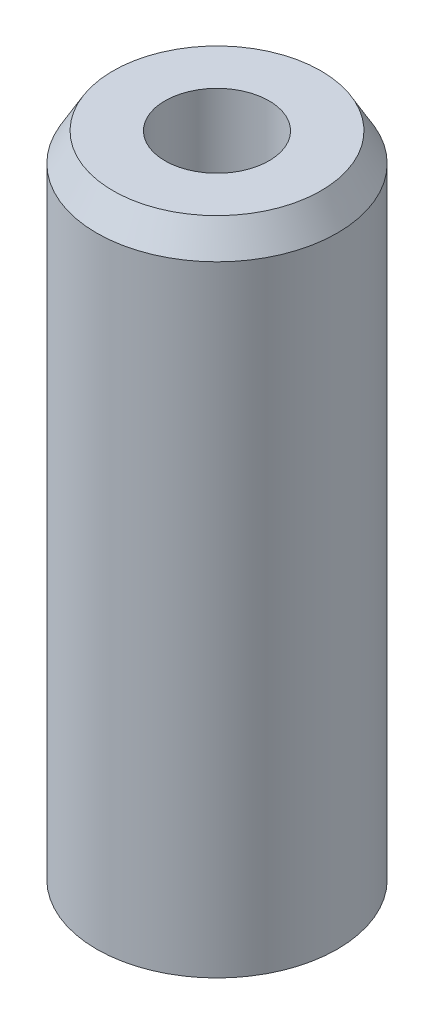
ISO-10303-21;
HEADER;
FILE_DESCRIPTION(('STEP AP214'),'2;1');
FILE_NAME('part.step','',(''),(''),'','','');
FILE_SCHEMA(('AUTOMOTIVE_DESIGN { 1 0 10303 214 1 1 1 1 }'));
ENDSEC;
DATA;
#1=APPLICATION_CONTEXT('core data for automotive mechanical design processes');
#2=APPLICATION_PROTOCOL_DEFINITION('international standard','automotive_design',2000,#1);
#3=PRODUCT_CONTEXT('',#1,'mechanical');
#4=PRODUCT('Part','Part','',(#3));
#5=PRODUCT_RELATED_PRODUCT_CATEGORY('part','',(#4));
#6=PRODUCT_DEFINITION_FORMATION('','',#4);
#7=PRODUCT_DEFINITION_CONTEXT('part definition',#1,'design');
#8=PRODUCT_DEFINITION('design','',#6,#7);
#9=PRODUCT_DEFINITION_SHAPE('','',#8);
#10=(LENGTH_UNIT() NAMED_UNIT(*) SI_UNIT(.MILLI.,.METRE.));
#11=(NAMED_UNIT(*) PLANE_ANGLE_UNIT() SI_UNIT($,.RADIAN.));
#12=(NAMED_UNIT(*) SI_UNIT($,.STERADIAN.) SOLID_ANGLE_UNIT());
#13=UNCERTAINTY_MEASURE_WITH_UNIT(LENGTH_MEASURE(1.E-05),#10,'distance_accuracy_value','');
#14=(GEOMETRIC_REPRESENTATION_CONTEXT(3) GLOBAL_UNCERTAINTY_ASSIGNED_CONTEXT((#13)) GLOBAL_UNIT_ASSIGNED_CONTEXT((#10,
#11,#12)) REPRESENTATION_CONTEXT('',''));
#15=CARTESIAN_POINT('',(0.,0.,0.));
#16=DIRECTION('',(0.,0.,1.));
#17=DIRECTION('',(1.,0.,0.));
#18=AXIS2_PLACEMENT_3D('',#15,#16,#17);
#19=CARTESIAN_POINT('',(0.,55.2616169271245,0.));
#20=DIRECTION('',(0.,-1.,0.));
#21=DIRECTION('',(0.,0.,-1.));
#22=AXIS2_PLACEMENT_3D('',#19,#20,#21);
#23=CYLINDRICAL_SURFACE('',#22,10.);
#24=CARTESIAN_POINT('',(0.,52.9019095037552,0.));
#25=DIRECTION('',(0.,1.,0.));
#26=DIRECTION('',(0.,0.,1.));
#27=AXIS2_PLACEMENT_3D('',#24,#25,#26);
#28=CIRCLE('',#27,10.);
#29=CARTESIAN_POINT('',(0.,52.9019095037552,-10.));
#30=VERTEX_POINT('',#29);
#31=EDGE_CURVE('E50',#30,#30,#28,.F.);
#32=ORIENTED_EDGE('',*,*,#31,.T.);
#33=EDGE_LOOP('',(#32));
#34=FACE_BOUND('',#33,.T.);
#35=CARTESIAN_POINT('',(0.,1.36237771609096,0.));
#36=DIRECTION('',(0.,1.,0.));
#37=DIRECTION('',(0.,0.,1.));
#38=AXIS2_PLACEMENT_3D('',#35,#36,#37);
#39=CIRCLE('',#38,10.);
#40=CARTESIAN_POINT('',(0.,1.36237771609096,10.));
#41=VERTEX_POINT('',#40);
#42=EDGE_CURVE('E51',#41,#41,#39,.T.);
#43=ORIENTED_EDGE('',*,*,#42,.T.);
#44=EDGE_LOOP('',(#43));
#45=FACE_BOUND('',#44,.T.);
#46=ADVANCED_FACE('F39',(#34,#45),#23,.T.);
#47=CARTESIAN_POINT('',(0.,55.2616169271245,0.));
#48=DIRECTION('',(0.,1.,0.));
#49=DIRECTION('',(0.,0.,1.));
#50=AXIS2_PLACEMENT_3D('',#47,#48,#49);
#51=PLANE('',#50);
#52=CARTESIAN_POINT('',(0.,55.2616169271245,0.));
#53=DIRECTION('',(0.,1.,0.));
#54=DIRECTION('',(0.,0.,1.));
#55=AXIS2_PLACEMENT_3D('',#52,#53,#54);
#56=CIRCLE('',#55,8.63762228390903);
#57=CARTESIAN_POINT('',(0.,55.2616169271245,-8.63762228390903));
#58=VERTEX_POINT('',#57);
#59=EDGE_CURVE('E54',#58,#58,#56,.T.);
#60=ORIENTED_EDGE('',*,*,#59,.T.);
#61=EDGE_LOOP('',(#60));
#62=FACE_BOUND('',#61,.T.);
#63=CARTESIAN_POINT('',(0.,55.2616169271245,0.));
#64=DIRECTION('',(0.,1.,0.));
#65=DIRECTION('',(0.,0.,1.));
#66=AXIS2_PLACEMENT_3D('',#63,#64,#65);
#67=CIRCLE('',#66,4.32399958381376);
#68=CARTESIAN_POINT('',(0.,55.2616169271245,4.32399958381376));
#69=VERTEX_POINT('',#68);
#70=EDGE_CURVE('E58',#69,#69,#67,.T.);
#71=ORIENTED_EDGE('',*,*,#70,.F.);
#72=EDGE_LOOP('',(#71));
#73=FACE_BOUND('',#72,.T.);
#74=ADVANCED_FACE('F69',(#62,#73),#51,.T.);
#75=CARTESIAN_POINT('',(0.,0.,0.));
#76=DIRECTION('',(0.,1.,0.));
#77=DIRECTION('',(0.,0.,1.));
#78=AXIS2_PLACEMENT_3D('',#75,#76,#77);
#79=PLANE('',#78);
#80=CARTESIAN_POINT('',(0.,0.,0.));
#81=DIRECTION('',(0.,1.,0.));
#82=DIRECTION('',(0.,0.,1.));
#83=AXIS2_PLACEMENT_3D('',#80,#81,#82);
#84=CIRCLE('',#83,7.64029257663081);
#85=CARTESIAN_POINT('',(0.,0.,7.64029257663081));
#86=VERTEX_POINT('',#85);
#87=EDGE_CURVE('E10',#86,#86,#84,.F.);
#88=ORIENTED_EDGE('',*,*,#87,.T.);
#89=EDGE_LOOP('',(#88));
#90=FACE_BOUND('',#89,.T.);
#91=CARTESIAN_POINT('',(0.,0.,0.));
#92=DIRECTION('',(0.,1.,0.));
#93=DIRECTION('',(0.,0.,1.));
#94=AXIS2_PLACEMENT_3D('',#91,#92,#93);
#95=CIRCLE('',#94,4.32399958381376);
#96=CARTESIAN_POINT('',(0.,0.,4.32399958381376));
#97=VERTEX_POINT('',#96);
#98=EDGE_CURVE('E63',#97,#97,#95,.T.);
#99=ORIENTED_EDGE('',*,*,#98,.T.);
#100=EDGE_LOOP('',(#99));
#101=FACE_BOUND('',#100,.T.);
#102=ADVANCED_FACE('F75',(#90,#101),#79,.F.);
#103=CARTESIAN_POINT('',(0.,55.2616169271245,0.));
#104=DIRECTION('',(0.,-1.,0.));
#105=DIRECTION('',(0.,0.,-1.));
#106=AXIS2_PLACEMENT_3D('',#103,#104,#105);
#107=CYLINDRICAL_SURFACE('',#106,4.32399958381376);
#108=ORIENTED_EDGE('',*,*,#70,.T.);
#109=EDGE_LOOP('',(#108));
#110=FACE_BOUND('',#109,.T.);
#111=ORIENTED_EDGE('',*,*,#98,.F.);
#112=EDGE_LOOP('',(#111));
#113=FACE_BOUND('',#112,.T.);
#114=ADVANCED_FACE('F70',(#110,#113),#107,.F.);
#115=CARTESIAN_POINT('',(0.,55.2616169271245,0.));
#116=DIRECTION('',(0.,-1.,0.));
#117=DIRECTION('',(0.,0.,-1.));
#118=AXIS2_PLACEMENT_3D('',#115,#116,#117);
#119=CONICAL_SURFACE('',#118,8.63762228390903,0.523598775598293);
#120=CARTESIAN_POINT('',(0.,52.9019095037552,-10.));
#121=CARTESIAN_POINT('',(0.,52.9264897894153,-9.98580856545739));
#122=CARTESIAN_POINT('',(0.,52.9510700750754,-9.97161713091477));
#123=CARTESIAN_POINT('',(0.,53.0002306463956,-9.94323426182955));
#124=CARTESIAN_POINT('',(0.,53.0248109320557,-9.92904282728693));
#125=CARTESIAN_POINT('',(0.,53.0739715033759,-9.9006599582017));
#126=CARTESIAN_POINT('',(0.,53.098551789036,-9.88646852365909));
#127=CARTESIAN_POINT('',(0.,53.1477123603562,-9.85808565457386));
#128=CARTESIAN_POINT('',(0.,53.1722926460163,-9.84389422003124));
#129=CARTESIAN_POINT('',(0.,53.2214532173365,-9.81551135094602));
#130=CARTESIAN_POINT('',(0.,53.2460335029966,-9.8013199164034));
#131=CARTESIAN_POINT('',(0.,53.2951940743168,-9.77293704731817));
#132=CARTESIAN_POINT('',(0.,53.3197743599769,-9.75874561277556));
#133=CARTESIAN_POINT('',(0.,53.3689349312971,-9.73036274369033));
#134=CARTESIAN_POINT('',(0.,53.3935152169572,-9.71617130914771));
#135=CARTESIAN_POINT('',(0.,53.4426757882774,-9.68778844006249));
#136=CARTESIAN_POINT('',(0.,53.4672560739375,-9.67359700551987));
#137=CARTESIAN_POINT('',(0.,53.5164166452577,-9.64521413643464));
#138=CARTESIAN_POINT('',(0.,53.5409969309177,-9.63102270189203));
#139=CARTESIAN_POINT('',(0.,53.5901575022379,-9.6026398328068));
#140=CARTESIAN_POINT('',(0.,53.614737787898,-9.58844839826419));
#141=CARTESIAN_POINT('',(0.,53.6638983592182,-9.56006552917896));
#142=CARTESIAN_POINT('',(0.,53.6884786448783,-9.54587409463634));
#143=CARTESIAN_POINT('',(0.,53.7376392161985,-9.51749122555112));
#144=CARTESIAN_POINT('',(0.,53.7622195018586,-9.5032997910085));
#145=CARTESIAN_POINT('',(0.,53.8113800731788,-9.47491692192327));
#146=CARTESIAN_POINT('',(0.,53.8359603588389,-9.46072548738066));
#147=CARTESIAN_POINT('',(0.,53.8851209301591,-9.43234261829543));
#148=CARTESIAN_POINT('',(0.,53.9097012158192,-9.41815118375281));
#149=CARTESIAN_POINT('',(0.,53.9588617871394,-9.38976831466759));
#150=CARTESIAN_POINT('',(0.,53.9834420727995,-9.37557688012497));
#151=CARTESIAN_POINT('',(0.,54.0326026441197,-9.34719401103974));
#152=CARTESIAN_POINT('',(0.,54.0571829297798,-9.33300257649713));
#153=CARTESIAN_POINT('',(0.,54.1063435011,-9.3046197074119));
#154=CARTESIAN_POINT('',(0.,54.1309237867601,-9.29042827286929));
#155=CARTESIAN_POINT('',(0.,54.1800843580803,-9.26204540378406));
#156=CARTESIAN_POINT('',(0.,54.2046646437404,-9.24785396924144));
#157=CARTESIAN_POINT('',(0.,54.2538252150605,-9.21947110015621));
#158=CARTESIAN_POINT('',(0.,54.2784055007206,-9.2052796656136));
#159=CARTESIAN_POINT('',(0.,54.3275660720408,-9.17689679652837));
#160=CARTESIAN_POINT('',(0.,54.3521463577009,-9.16270536198576));
#161=CARTESIAN_POINT('',(0.,54.4013069290211,-9.13432249290053));
#162=CARTESIAN_POINT('',(0.,54.4258872146812,-9.12013105835791));
#163=CARTESIAN_POINT('',(0.,54.4750477860014,-9.09174818927269));
#164=CARTESIAN_POINT('',(0.,54.4996280716615,-9.07755675473007));
#165=CARTESIAN_POINT('',(0.,54.5487886429817,-9.04917388564484));
#166=CARTESIAN_POINT('',(0.,54.5733689286418,-9.03498245110223));
#167=CARTESIAN_POINT('',(0.,54.622529499962,-9.006599582017));
#168=CARTESIAN_POINT('',(0.,54.6471097856221,-8.99240814747439));
#169=CARTESIAN_POINT('',(0.,54.6962703569423,-8.96402527838916));
#170=CARTESIAN_POINT('',(0.,54.7208506426024,-8.94983384384654));
#171=CARTESIAN_POINT('',(0.,54.7700112139226,-8.92145097476131));
#172=CARTESIAN_POINT('',(0.,54.7945914995827,-8.9072595402187));
#173=CARTESIAN_POINT('',(0.,54.8437520709029,-8.87887667113347));
#174=CARTESIAN_POINT('',(0.,54.868332356563,-8.86468523659086));
#175=CARTESIAN_POINT('',(0.,54.9174929278831,-8.83630236750563));
#176=CARTESIAN_POINT('',(0.,54.9420732135432,-8.82211093296301));
#177=CARTESIAN_POINT('',(0.,54.9912337848634,-8.79372806387779));
#178=CARTESIAN_POINT('',(0.,55.0158140705235,-8.77953662933517));
#179=CARTESIAN_POINT('',(0.,55.0649746418437,-8.75115376024994));
#180=CARTESIAN_POINT('',(0.,55.0895549275038,-8.73696232570733));
#181=CARTESIAN_POINT('',(0.,55.138715498824,-8.7085794566221));
#182=CARTESIAN_POINT('',(0.,55.1632957844841,-8.69438802207948));
#183=CARTESIAN_POINT('',(0.,55.2124563558043,-8.66600515299426));
#184=CARTESIAN_POINT('',(0.,55.2370366414644,-8.65181371845164));
#185=CARTESIAN_POINT('',(0.,55.2616169271245,-8.63762228390903));
#186=B_SPLINE_CURVE_WITH_KNOTS('',3,(#120,#121,#122,#123,#124,#125,#126,#127,#128,#129,#130,
#131,#132,#133,#134,#135,#136,#137,#138,#139,#140,#141,#142,#143,#144,#145,#146,#147,#148,#149,
#150,#151,#152,#153,#154,#155,#156,#157,#158,#159,#160,#161,#162,#163,#164,#165,#166,#167,#168,
#169,#170,#171,#172,#173,#174,#175,#176,#177,#178,#179,#180,#181,#182,#183,#184,#185),
.UNSPECIFIED.,.F.,.F.,(4,2,2,2,2,2,2,2,2,2,2,2,2,2,2,2,2,2,2,2,2,2,2,2,2,2,2,2,2,2,2,2,4),(0.,
0.0851486072556853,0.170297214511372,0.255445821767058,0.340594429022744,0.425743036278429,
0.510891643534116,0.596040250789802,0.681188858045494,0.766337465301179,0.851486072556865,
0.936634679812552,1.02178328706824,1.10693189432392,1.19208050157961,1.2772291088353,
1.36237771609099,1.44752632334667,1.53267493060236,1.61782353785805,1.70297214511373,
1.78812075236942,1.8732693596251,1.95841796688079,2.04356657413648,2.12871518139217,
2.21386378864785,2.29901239590354,2.38416100315922,2.46930961041491,2.5544582176706,
2.63960682492628,2.72475543218197),.UNSPECIFIED.);
#187=EDGE_CURVE('BSEAM81',#30,#58,#186,.T.);
#188=ORIENTED_EDGE('',*,*,#31,.F.);
#189=ORIENTED_EDGE('',*,*,#59,.F.);
#190=ORIENTED_EDGE('',*,*,#187,.T.);
#191=ORIENTED_EDGE('',*,*,#187,.F.);
#192=EDGE_LOOP('',(#188,#190,#189,#191));
#193=FACE_BOUND('',#192,.T.);
#194=ADVANCED_FACE('F81',(#193),#119,.T.);
#195=CARTESIAN_POINT('',(0.,1.36237771609096,0.));
#196=DIRECTION('',(0.,1.,0.));
#197=DIRECTION('',(0.,0.,1.));
#198=AXIS2_PLACEMENT_3D('',#195,#196,#197);
#199=CONICAL_SURFACE('',#198,10.,1.0471975511966);
#200=ORIENTED_EDGE('',*,*,#87,.F.);
#201=EDGE_LOOP('',(#200));
#202=FACE_BOUND('',#201,.T.);
#203=ORIENTED_EDGE('',*,*,#42,.F.);
#204=EDGE_LOOP('',(#203));
#205=FACE_BOUND('',#204,.T.);
#206=ADVANCED_FACE('F45',(#202,#205),#199,.T.);
#207=CLOSED_SHELL('',(#46,#74,#102,#114,#194,#206));
#208=MANIFOLD_SOLID_BREP('B2',#207);
#209=ADVANCED_BREP_SHAPE_REPRESENTATION('',(#18,#208),#14);
#210=SHAPE_DEFINITION_REPRESENTATION(#9,#209);
ENDSEC;
END-ISO-10303-21;
